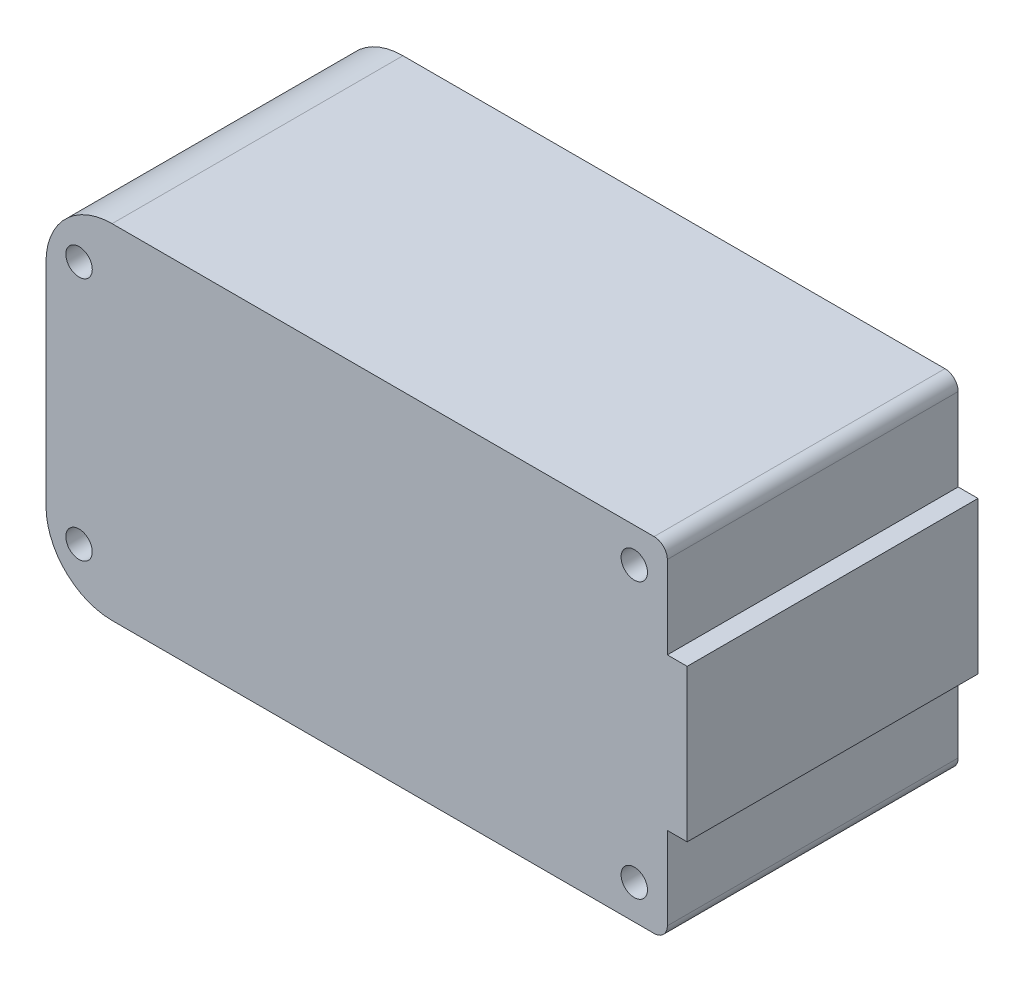
ISO-10303-21;
HEADER;
FILE_DESCRIPTION(('STEP AP214'),'2;1');
FILE_NAME('part.step','',(''),(''),'','','');
FILE_SCHEMA(('AUTOMOTIVE_DESIGN { 1 0 10303 214 1 1 1 1 }'));
ENDSEC;
DATA;
#1=APPLICATION_CONTEXT('core data for automotive mechanical design processes');
#2=APPLICATION_PROTOCOL_DEFINITION('international standard','automotive_design',2000,#1);
#3=PRODUCT_CONTEXT('',#1,'mechanical');
#4=PRODUCT('Part','Part','',(#3));
#5=PRODUCT_RELATED_PRODUCT_CATEGORY('part','',(#4));
#6=PRODUCT_DEFINITION_FORMATION('','',#4);
#7=PRODUCT_DEFINITION_CONTEXT('part definition',#1,'design');
#8=PRODUCT_DEFINITION('design','',#6,#7);
#9=PRODUCT_DEFINITION_SHAPE('','',#8);
#10=(LENGTH_UNIT() NAMED_UNIT(*) SI_UNIT(.MILLI.,.METRE.));
#11=(NAMED_UNIT(*) PLANE_ANGLE_UNIT() SI_UNIT($,.RADIAN.));
#12=(NAMED_UNIT(*) SI_UNIT($,.STERADIAN.) SOLID_ANGLE_UNIT());
#13=UNCERTAINTY_MEASURE_WITH_UNIT(LENGTH_MEASURE(1.E-05),#10,'distance_accuracy_value','');
#14=(GEOMETRIC_REPRESENTATION_CONTEXT(3) GLOBAL_UNCERTAINTY_ASSIGNED_CONTEXT((#13)) GLOBAL_UNIT_ASSIGNED_CONTEXT((#10,
#11,#12)) REPRESENTATION_CONTEXT('',''));
#15=CARTESIAN_POINT('',(0.,0.,0.));
#16=DIRECTION('',(0.,0.,1.));
#17=DIRECTION('',(1.,0.,0.));
#18=AXIS2_PLACEMENT_3D('',#15,#16,#17);
#19=CARTESIAN_POINT('',(0.,0.,11.));
#20=DIRECTION('',(0.,0.,1.));
#21=DIRECTION('',(1.,0.,0.));
#22=AXIS2_PLACEMENT_3D('',#19,#20,#21);
#23=PLANE('',#22);
#24=CARTESIAN_POINT('',(33.,-10.4,11.));
#25=DIRECTION('',(0.,0.,1.));
#26=DIRECTION('',(-1.,0.,0.));
#27=AXIS2_PLACEMENT_3D('',#24,#25,#26);
#28=CIRCLE('',#27,0.999999999999998);
#29=CARTESIAN_POINT('',(32.,-10.4,11.));
#30=VERTEX_POINT('',#29);
#31=EDGE_CURVE('E314',#30,#30,#28,.T.);
#32=ORIENTED_EDGE('',*,*,#31,.F.);
#33=EDGE_LOOP('',(#32));
#34=FACE_BOUND('',#33,.T.);
#35=CARTESIAN_POINT('',(-9.,9.25,11.));
#36=DIRECTION('',(0.,0.,1.));
#37=DIRECTION('',(1.,0.,0.));
#38=AXIS2_PLACEMENT_3D('',#35,#36,#37);
#39=CIRCLE('',#38,1.);
#40=CARTESIAN_POINT('',(-7.99999999999999,9.25,11.));
#41=VERTEX_POINT('',#40);
#42=EDGE_CURVE('E183',#41,#41,#39,.T.);
#43=ORIENTED_EDGE('',*,*,#42,.F.);
#44=EDGE_LOOP('',(#43));
#45=FACE_BOUND('',#44,.T.);
#46=DIRECTION('',(0.,1.,0.));
#47=VECTOR('',#46,1.);
#48=CARTESIAN_POINT('',(35.5,5.75,11.));
#49=LINE('',#48,#47);
#50=CARTESIAN_POINT('',(35.5,5.75,11.));
#51=VERTEX_POINT('',#50);
#52=CARTESIAN_POINT('',(35.5,12.,11.));
#53=VERTEX_POINT('',#52);
#54=EDGE_CURVE('E171',#51,#53,#49,.T.);
#55=ORIENTED_EDGE('',*,*,#54,.T.);
#56=CARTESIAN_POINT('',(34.5,12.,11.));
#57=DIRECTION('',(0.,0.,1.));
#58=DIRECTION('',(1.,0.,0.));
#59=AXIS2_PLACEMENT_3D('',#56,#57,#58);
#60=CIRCLE('',#59,1.);
#61=CARTESIAN_POINT('',(34.5,13.,11.));
#62=VERTEX_POINT('',#61);
#63=EDGE_CURVE('E256',#53,#62,#60,.T.);
#64=ORIENTED_EDGE('',*,*,#63,.T.);
#65=DIRECTION('',(-1.,0.,0.));
#66=VECTOR('',#65,1.);
#67=CARTESIAN_POINT('',(35.5,13.,11.));
#68=LINE('',#67,#66);
#69=CARTESIAN_POINT('',(-6.5,13.,11.));
#70=VERTEX_POINT('',#69);
#71=EDGE_CURVE('E174',#62,#70,#68,.T.);
#72=ORIENTED_EDGE('',*,*,#71,.T.);
#73=CARTESIAN_POINT('',(-6.5,7.99999999999999,11.));
#74=DIRECTION('',(0.,0.,1.));
#75=DIRECTION('',(1.,0.,0.));
#76=AXIS2_PLACEMENT_3D('',#73,#74,#75);
#77=CIRCLE('',#76,5.);
#78=CARTESIAN_POINT('',(-11.5,7.99999999999999,11.));
#79=VERTEX_POINT('',#78);
#80=EDGE_CURVE('E234',#70,#79,#77,.T.);
#81=ORIENTED_EDGE('',*,*,#80,.T.);
#82=DIRECTION('',(0.,-1.,0.));
#83=VECTOR('',#82,1.);
#84=CARTESIAN_POINT('',(-11.5,-13.,11.));
#85=LINE('',#84,#83);
#86=CARTESIAN_POINT('',(-11.5,-8.00000000000001,11.));
#87=VERTEX_POINT('',#86);
#88=EDGE_CURVE('E204',#79,#87,#85,.T.);
#89=ORIENTED_EDGE('',*,*,#88,.T.);
#90=CARTESIAN_POINT('',(-6.5,-8.,11.));
#91=DIRECTION('',(0.,0.,1.));
#92=DIRECTION('',(1.,0.,0.));
#93=AXIS2_PLACEMENT_3D('',#90,#91,#92);
#94=CIRCLE('',#93,5.);
#95=CARTESIAN_POINT('',(-6.5,-13.,11.));
#96=VERTEX_POINT('',#95);
#97=EDGE_CURVE('E231',#87,#96,#94,.T.);
#98=ORIENTED_EDGE('',*,*,#97,.T.);
#99=DIRECTION('',(1.,0.,0.));
#100=VECTOR('',#99,1.);
#101=CARTESIAN_POINT('',(35.5,-13.,11.));
#102=LINE('',#101,#100);
#103=CARTESIAN_POINT('',(34.5,-13.,11.));
#104=VERTEX_POINT('',#103);
#105=EDGE_CURVE('E145',#96,#104,#102,.T.);
#106=ORIENTED_EDGE('',*,*,#105,.T.);
#107=CARTESIAN_POINT('',(34.5,-12.,11.));
#108=DIRECTION('',(0.,0.,1.));
#109=DIRECTION('',(1.,0.,0.));
#110=AXIS2_PLACEMENT_3D('',#107,#108,#109);
#111=CIRCLE('',#110,1.);
#112=CARTESIAN_POINT('',(35.5,-12.,11.));
#113=VERTEX_POINT('',#112);
#114=EDGE_CURVE('E63',#104,#113,#111,.T.);
#115=ORIENTED_EDGE('',*,*,#114,.T.);
#116=DIRECTION('',(0.,1.,0.));
#117=VECTOR('',#116,1.);
#118=CARTESIAN_POINT('',(35.5,-13.,11.));
#119=LINE('',#118,#117);
#120=CARTESIAN_POINT('',(35.5,-5.75,11.));
#121=VERTEX_POINT('',#120);
#122=EDGE_CURVE('E134',#113,#121,#119,.T.);
#123=ORIENTED_EDGE('',*,*,#122,.T.);
#124=DIRECTION('',(1.,0.,0.));
#125=VECTOR('',#124,1.);
#126=CARTESIAN_POINT('',(35.5,-5.75,11.));
#127=LINE('',#126,#125);
#128=CARTESIAN_POINT('',(37.,-5.75,11.));
#129=VERTEX_POINT('',#128);
#130=EDGE_CURVE('E139',#121,#129,#127,.T.);
#131=ORIENTED_EDGE('',*,*,#130,.T.);
#132=DIRECTION('',(0.,1.,0.));
#133=VECTOR('',#132,1.);
#134=CARTESIAN_POINT('',(37.,5.75,11.));
#135=LINE('',#134,#133);
#136=CARTESIAN_POINT('',(37.,5.75,11.));
#137=VERTEX_POINT('',#136);
#138=EDGE_CURVE('E162',#129,#137,#135,.T.);
#139=ORIENTED_EDGE('',*,*,#138,.T.);
#140=DIRECTION('',(-1.,0.,0.));
#141=VECTOR('',#140,1.);
#142=CARTESIAN_POINT('',(35.5,5.75,11.));
#143=LINE('',#142,#141);
#144=EDGE_CURVE('E165',#137,#51,#143,.T.);
#145=ORIENTED_EDGE('',*,*,#144,.T.);
#146=EDGE_LOOP('',(#55,#64,#72,#81,#89,#98,#106,#115,#123,#131,#139,#145));
#147=FACE_BOUND('',#146,.T.);
#148=CARTESIAN_POINT('',(33.,10.4,11.));
#149=DIRECTION('',(0.,0.,1.));
#150=DIRECTION('',(1.,0.,0.));
#151=AXIS2_PLACEMENT_3D('',#148,#149,#150);
#152=CIRCLE('',#151,0.999999999999998);
#153=CARTESIAN_POINT('',(34.,10.4,11.));
#154=VERTEX_POINT('',#153);
#155=EDGE_CURVE('E306',#154,#154,#152,.T.);
#156=ORIENTED_EDGE('',*,*,#155,.F.);
#157=EDGE_LOOP('',(#156));
#158=FACE_BOUND('',#157,.T.);
#159=CARTESIAN_POINT('',(-9.,-9.25,11.));
#160=DIRECTION('',(0.,0.,1.));
#161=DIRECTION('',(-1.,0.,0.));
#162=AXIS2_PLACEMENT_3D('',#159,#160,#161);
#163=CIRCLE('',#162,1.);
#164=CARTESIAN_POINT('',(-10.,-9.25,11.));
#165=VERTEX_POINT('',#164);
#166=EDGE_CURVE('E322',#165,#165,#163,.T.);
#167=ORIENTED_EDGE('',*,*,#166,.F.);
#168=EDGE_LOOP('',(#167));
#169=FACE_BOUND('',#168,.T.);
#170=ADVANCED_FACE('F47',(#34,#45,#147,#158,#169),#23,.T.);
#171=CARTESIAN_POINT('',(0.,0.,-11.));
#172=DIRECTION('',(0.,0.,1.));
#173=DIRECTION('',(1.,0.,0.));
#174=AXIS2_PLACEMENT_3D('',#171,#172,#173);
#175=PLANE('',#174);
#176=CARTESIAN_POINT('',(33.,-10.4,-11.));
#177=DIRECTION('',(0.,0.,1.));
#178=DIRECTION('',(-1.,0.,0.));
#179=AXIS2_PLACEMENT_3D('',#176,#177,#178);
#180=CIRCLE('',#179,0.999999999999998);
#181=CARTESIAN_POINT('',(32.,-10.4,-11.));
#182=VERTEX_POINT('',#181);
#183=EDGE_CURVE('E318',#182,#182,#180,.T.);
#184=ORIENTED_EDGE('',*,*,#183,.T.);
#185=EDGE_LOOP('',(#184));
#186=FACE_BOUND('',#185,.T.);
#187=CARTESIAN_POINT('',(-9.,9.25,-11.));
#188=DIRECTION('',(0.,0.,1.));
#189=DIRECTION('',(1.,0.,0.));
#190=AXIS2_PLACEMENT_3D('',#187,#188,#189);
#191=CIRCLE('',#190,1.);
#192=CARTESIAN_POINT('',(-7.99999999999999,9.25,-11.));
#193=VERTEX_POINT('',#192);
#194=EDGE_CURVE('E302',#193,#193,#191,.T.);
#195=ORIENTED_EDGE('',*,*,#194,.T.);
#196=EDGE_LOOP('',(#195));
#197=FACE_BOUND('',#196,.T.);
#198=DIRECTION('',(-1.,0.,0.));
#199=VECTOR('',#198,1.);
#200=CARTESIAN_POINT('',(35.5,13.,-11.));
#201=LINE('',#200,#199);
#202=CARTESIAN_POINT('',(34.5,13.,-11.));
#203=VERTEX_POINT('',#202);
#204=CARTESIAN_POINT('',(-6.5,13.,-11.));
#205=VERTEX_POINT('',#204);
#206=EDGE_CURVE('E201',#203,#205,#201,.T.);
#207=ORIENTED_EDGE('',*,*,#206,.F.);
#208=CARTESIAN_POINT('',(34.5,12.,-11.));
#209=DIRECTION('',(0.,0.,1.));
#210=DIRECTION('',(1.,0.,0.));
#211=AXIS2_PLACEMENT_3D('',#208,#209,#210);
#212=CIRCLE('',#211,1.);
#213=CARTESIAN_POINT('',(35.5,12.,-11.));
#214=VERTEX_POINT('',#213);
#215=EDGE_CURVE('E248',#203,#214,#212,.F.);
#216=ORIENTED_EDGE('',*,*,#215,.T.);
#217=DIRECTION('',(0.,1.,0.));
#218=VECTOR('',#217,1.);
#219=CARTESIAN_POINT('',(35.5,5.75,-11.));
#220=LINE('',#219,#218);
#221=CARTESIAN_POINT('',(35.5,5.75,-11.));
#222=VERTEX_POINT('',#221);
#223=EDGE_CURVE('E197',#222,#214,#220,.T.);
#224=ORIENTED_EDGE('',*,*,#223,.F.);
#225=DIRECTION('',(-1.,0.,0.));
#226=VECTOR('',#225,1.);
#227=CARTESIAN_POINT('',(35.5,5.75,-11.));
#228=LINE('',#227,#226);
#229=CARTESIAN_POINT('',(37.,5.75,-11.));
#230=VERTEX_POINT('',#229);
#231=EDGE_CURVE('E194',#230,#222,#228,.T.);
#232=ORIENTED_EDGE('',*,*,#231,.F.);
#233=DIRECTION('',(0.,1.,0.));
#234=VECTOR('',#233,1.);
#235=CARTESIAN_POINT('',(37.,5.75,-11.));
#236=LINE('',#235,#234);
#237=CARTESIAN_POINT('',(37.,-5.75,-11.));
#238=VERTEX_POINT('',#237);
#239=EDGE_CURVE('E191',#238,#230,#236,.T.);
#240=ORIENTED_EDGE('',*,*,#239,.F.);
#241=DIRECTION('',(1.,0.,0.));
#242=VECTOR('',#241,1.);
#243=CARTESIAN_POINT('',(35.5,-5.75,-11.));
#244=LINE('',#243,#242);
#245=CARTESIAN_POINT('',(35.5,-5.75,-11.));
#246=VERTEX_POINT('',#245);
#247=EDGE_CURVE('E188',#246,#238,#244,.T.);
#248=ORIENTED_EDGE('',*,*,#247,.F.);
#249=DIRECTION('',(0.,1.,0.));
#250=VECTOR('',#249,1.);
#251=CARTESIAN_POINT('',(35.5,-13.,-11.));
#252=LINE('',#251,#250);
#253=CARTESIAN_POINT('',(35.5,-12.,-11.));
#254=VERTEX_POINT('',#253);
#255=EDGE_CURVE('E151',#254,#246,#252,.T.);
#256=ORIENTED_EDGE('',*,*,#255,.F.);
#257=CARTESIAN_POINT('',(34.5,-12.,-11.));
#258=DIRECTION('',(0.,0.,1.));
#259=DIRECTION('',(1.,0.,0.));
#260=AXIS2_PLACEMENT_3D('',#257,#258,#259);
#261=CIRCLE('',#260,1.);
#262=CARTESIAN_POINT('',(34.5,-13.,-11.));
#263=VERTEX_POINT('',#262);
#264=EDGE_CURVE('E245',#254,#263,#261,.F.);
#265=ORIENTED_EDGE('',*,*,#264,.T.);
#266=DIRECTION('',(1.,0.,0.));
#267=VECTOR('',#266,1.);
#268=CARTESIAN_POINT('',(35.5,-13.,-11.));
#269=LINE('',#268,#267);
#270=CARTESIAN_POINT('',(-6.5,-13.,-11.));
#271=VERTEX_POINT('',#270);
#272=EDGE_CURVE('E182',#271,#263,#269,.T.);
#273=ORIENTED_EDGE('',*,*,#272,.F.);
#274=CARTESIAN_POINT('',(-6.5,-8.,-11.));
#275=DIRECTION('',(0.,0.,1.));
#276=DIRECTION('',(1.,0.,0.));
#277=AXIS2_PLACEMENT_3D('',#274,#275,#276);
#278=CIRCLE('',#277,5.);
#279=CARTESIAN_POINT('',(-11.5,-8.00000000000001,-11.));
#280=VERTEX_POINT('',#279);
#281=EDGE_CURVE('E220',#271,#280,#278,.F.);
#282=ORIENTED_EDGE('',*,*,#281,.T.);
#283=DIRECTION('',(0.,-1.,0.));
#284=VECTOR('',#283,1.);
#285=CARTESIAN_POINT('',(-11.5,-13.,-11.));
#286=LINE('',#285,#284);
#287=CARTESIAN_POINT('',(-11.5,7.99999999999999,-11.));
#288=VERTEX_POINT('',#287);
#289=EDGE_CURVE('E178',#288,#280,#286,.T.);
#290=ORIENTED_EDGE('',*,*,#289,.F.);
#291=CARTESIAN_POINT('',(-6.5,7.99999999999999,-11.));
#292=DIRECTION('',(0.,0.,1.));
#293=DIRECTION('',(1.,0.,0.));
#294=AXIS2_PLACEMENT_3D('',#291,#292,#293);
#295=CIRCLE('',#294,5.);
#296=EDGE_CURVE('E223',#288,#205,#295,.F.);
#297=ORIENTED_EDGE('',*,*,#296,.T.);
#298=EDGE_LOOP('',(#207,#216,#224,#232,#240,#248,#256,#265,#273,#282,#290,#297));
#299=FACE_BOUND('',#298,.T.);
#300=CARTESIAN_POINT('',(33.,10.4,-11.));
#301=DIRECTION('',(0.,0.,1.));
#302=DIRECTION('',(1.,0.,0.));
#303=AXIS2_PLACEMENT_3D('',#300,#301,#302);
#304=CIRCLE('',#303,0.999999999999998);
#305=CARTESIAN_POINT('',(34.,10.4,-11.));
#306=VERTEX_POINT('',#305);
#307=EDGE_CURVE('E310',#306,#306,#304,.T.);
#308=ORIENTED_EDGE('',*,*,#307,.T.);
#309=EDGE_LOOP('',(#308));
#310=FACE_BOUND('',#309,.T.);
#311=CARTESIAN_POINT('',(-9.,-9.25,-11.));
#312=DIRECTION('',(0.,0.,1.));
#313=DIRECTION('',(-1.,0.,0.));
#314=AXIS2_PLACEMENT_3D('',#311,#312,#313);
#315=CIRCLE('',#314,1.);
#316=CARTESIAN_POINT('',(-10.,-9.25,-11.));
#317=VERTEX_POINT('',#316);
#318=EDGE_CURVE('E326',#317,#317,#315,.T.);
#319=ORIENTED_EDGE('',*,*,#318,.T.);
#320=EDGE_LOOP('',(#319));
#321=FACE_BOUND('',#320,.T.);
#322=ADVANCED_FACE('F262',(#186,#197,#299,#310,#321),#175,.F.);
#323=CARTESIAN_POINT('',(-11.5,-13.,11.));
#324=DIRECTION('',(1.,0.,0.));
#325=DIRECTION('',(0.,1.,0.));
#326=AXIS2_PLACEMENT_3D('',#323,#324,#325);
#327=PLANE('',#326);
#328=ORIENTED_EDGE('',*,*,#88,.F.);
#329=DIRECTION('',(0.,0.,-1.));
#330=VECTOR('',#329,1.);
#331=CARTESIAN_POINT('',(-11.5,7.99999999999999,11.));
#332=LINE('',#331,#330);
#333=EDGE_CURVE('E216',#79,#288,#332,.T.);
#334=ORIENTED_EDGE('',*,*,#333,.T.);
#335=ORIENTED_EDGE('',*,*,#289,.T.);
#336=DIRECTION('',(0.,0.,-1.));
#337=VECTOR('',#336,1.);
#338=CARTESIAN_POINT('',(-11.5,-8.,11.));
#339=LINE('',#338,#337);
#340=EDGE_CURVE('E155',#280,#87,#339,.F.);
#341=ORIENTED_EDGE('',*,*,#340,.T.);
#342=EDGE_LOOP('',(#328,#334,#335,#341));
#343=FACE_BOUND('',#342,.T.);
#344=ADVANCED_FACE('F295',(#343),#327,.F.);
#345=CARTESIAN_POINT('',(35.5,-13.,11.));
#346=DIRECTION('',(0.,1.,0.));
#347=DIRECTION('',(-1.,0.,0.));
#348=AXIS2_PLACEMENT_3D('',#345,#346,#347);
#349=PLANE('',#348);
#350=ORIENTED_EDGE('',*,*,#272,.T.);
#351=DIRECTION('',(0.,0.,-1.));
#352=VECTOR('',#351,1.);
#353=CARTESIAN_POINT('',(34.5,-13.,11.));
#354=LINE('',#353,#352);
#355=EDGE_CURVE('E11',#263,#104,#354,.F.);
#356=ORIENTED_EDGE('',*,*,#355,.T.);
#357=ORIENTED_EDGE('',*,*,#105,.F.);
#358=DIRECTION('',(0.,0.,-1.));
#359=VECTOR('',#358,1.);
#360=CARTESIAN_POINT('',(-6.5,-13.,11.));
#361=LINE('',#360,#359);
#362=EDGE_CURVE('E237',#96,#271,#361,.T.);
#363=ORIENTED_EDGE('',*,*,#362,.T.);
#364=EDGE_LOOP('',(#350,#356,#357,#363));
#365=FACE_BOUND('',#364,.T.);
#366=ADVANCED_FACE('F362',(#365),#349,.F.);
#367=CARTESIAN_POINT('',(35.5,-13.,11.));
#368=DIRECTION('',(-1.,0.,0.));
#369=DIRECTION('',(0.,0.,1.));
#370=AXIS2_PLACEMENT_3D('',#367,#368,#369);
#371=PLANE('',#370);
#372=ORIENTED_EDGE('',*,*,#122,.F.);
#373=DIRECTION('',(0.,0.,-1.));
#374=VECTOR('',#373,1.);
#375=CARTESIAN_POINT('',(35.5,-12.,11.));
#376=LINE('',#375,#374);
#377=EDGE_CURVE('E56',#113,#254,#376,.T.);
#378=ORIENTED_EDGE('',*,*,#377,.T.);
#379=ORIENTED_EDGE('',*,*,#255,.T.);
#380=DIRECTION('',(0.,0.,-1.));
#381=VECTOR('',#380,1.);
#382=CARTESIAN_POINT('',(35.5,-5.75,11.));
#383=LINE('',#382,#381);
#384=EDGE_CURVE('E148',#121,#246,#383,.T.);
#385=ORIENTED_EDGE('',*,*,#384,.F.);
#386=EDGE_LOOP('',(#372,#378,#379,#385));
#387=FACE_BOUND('',#386,.T.);
#388=ADVANCED_FACE('F149',(#387),#371,.F.);
#389=CARTESIAN_POINT('',(35.5,-5.75,11.));
#390=DIRECTION('',(0.,1.,0.));
#391=DIRECTION('',(0.,0.,1.));
#392=AXIS2_PLACEMENT_3D('',#389,#390,#391);
#393=PLANE('',#392);
#394=ORIENTED_EDGE('',*,*,#247,.T.);
#395=DIRECTION('',(0.,0.,-1.));
#396=VECTOR('',#395,1.);
#397=CARTESIAN_POINT('',(37.,-5.75,11.));
#398=LINE('',#397,#396);
#399=EDGE_CURVE('E156',#129,#238,#398,.T.);
#400=ORIENTED_EDGE('',*,*,#399,.F.);
#401=ORIENTED_EDGE('',*,*,#130,.F.);
#402=ORIENTED_EDGE('',*,*,#384,.T.);
#403=EDGE_LOOP('',(#394,#400,#401,#402));
#404=FACE_BOUND('',#403,.T.);
#405=ADVANCED_FACE('F158',(#404),#393,.F.);
#406=CARTESIAN_POINT('',(37.,5.75,11.));
#407=DIRECTION('',(-1.,0.,0.));
#408=DIRECTION('',(0.,0.,1.));
#409=AXIS2_PLACEMENT_3D('',#406,#407,#408);
#410=PLANE('',#409);
#411=ORIENTED_EDGE('',*,*,#239,.T.);
#412=DIRECTION('',(0.,0.,-1.));
#413=VECTOR('',#412,1.);
#414=CARTESIAN_POINT('',(37.,5.75,11.));
#415=LINE('',#414,#413);
#416=EDGE_CURVE('E208',#137,#230,#415,.T.);
#417=ORIENTED_EDGE('',*,*,#416,.F.);
#418=ORIENTED_EDGE('',*,*,#138,.F.);
#419=ORIENTED_EDGE('',*,*,#399,.T.);
#420=EDGE_LOOP('',(#411,#417,#418,#419));
#421=FACE_BOUND('',#420,.T.);
#422=ADVANCED_FACE('F268',(#421),#410,.F.);
#423=CARTESIAN_POINT('',(35.5,5.75,11.));
#424=DIRECTION('',(0.,-1.,0.));
#425=DIRECTION('',(0.,0.,-1.));
#426=AXIS2_PLACEMENT_3D('',#423,#424,#425);
#427=PLANE('',#426);
#428=ORIENTED_EDGE('',*,*,#231,.T.);
#429=DIRECTION('',(0.,0.,-1.));
#430=VECTOR('',#429,1.);
#431=CARTESIAN_POINT('',(35.5,5.75,11.));
#432=LINE('',#431,#430);
#433=EDGE_CURVE('E177',#51,#222,#432,.T.);
#434=ORIENTED_EDGE('',*,*,#433,.F.);
#435=ORIENTED_EDGE('',*,*,#144,.F.);
#436=ORIENTED_EDGE('',*,*,#416,.T.);
#437=EDGE_LOOP('',(#428,#434,#435,#436));
#438=FACE_BOUND('',#437,.T.);
#439=ADVANCED_FACE('F275',(#438),#427,.F.);
#440=CARTESIAN_POINT('',(35.5,5.75,11.));
#441=DIRECTION('',(-1.,0.,0.));
#442=DIRECTION('',(0.,0.,1.));
#443=AXIS2_PLACEMENT_3D('',#440,#441,#442);
#444=PLANE('',#443);
#445=ORIENTED_EDGE('',*,*,#223,.T.);
#446=DIRECTION('',(0.,0.,-1.));
#447=VECTOR('',#446,1.);
#448=CARTESIAN_POINT('',(35.5,12.,11.));
#449=LINE('',#448,#447);
#450=EDGE_CURVE('E251',#214,#53,#449,.F.);
#451=ORIENTED_EDGE('',*,*,#450,.T.);
#452=ORIENTED_EDGE('',*,*,#54,.F.);
#453=ORIENTED_EDGE('',*,*,#433,.T.);
#454=EDGE_LOOP('',(#445,#451,#452,#453));
#455=FACE_BOUND('',#454,.T.);
#456=ADVANCED_FACE('F278',(#455),#444,.F.);
#457=CARTESIAN_POINT('',(35.5,13.,11.));
#458=DIRECTION('',(0.,-1.,0.));
#459=DIRECTION('',(1.,0.,0.));
#460=AXIS2_PLACEMENT_3D('',#457,#458,#459);
#461=PLANE('',#460);
#462=ORIENTED_EDGE('',*,*,#71,.F.);
#463=DIRECTION('',(0.,0.,-1.));
#464=VECTOR('',#463,1.);
#465=CARTESIAN_POINT('',(34.5,13.,11.));
#466=LINE('',#465,#464);
#467=EDGE_CURVE('E241',#62,#203,#466,.T.);
#468=ORIENTED_EDGE('',*,*,#467,.T.);
#469=ORIENTED_EDGE('',*,*,#206,.T.);
#470=DIRECTION('',(0.,0.,-1.));
#471=VECTOR('',#470,1.);
#472=CARTESIAN_POINT('',(-6.5,13.,11.));
#473=LINE('',#472,#471);
#474=EDGE_CURVE('E227',#205,#70,#473,.F.);
#475=ORIENTED_EDGE('',*,*,#474,.T.);
#476=EDGE_LOOP('',(#462,#468,#469,#475));
#477=FACE_BOUND('',#476,.T.);
#478=ADVANCED_FACE('F285',(#477),#461,.F.);
#479=CARTESIAN_POINT('',(-9.,9.25,11.));
#480=DIRECTION('',(0.,0.,-1.));
#481=DIRECTION('',(-1.,0.,0.));
#482=AXIS2_PLACEMENT_3D('',#479,#480,#481);
#483=CYLINDRICAL_SURFACE('',#482,1.);
#484=ORIENTED_EDGE('',*,*,#42,.T.);
#485=EDGE_LOOP('',(#484));
#486=FACE_BOUND('',#485,.T.);
#487=ORIENTED_EDGE('',*,*,#194,.F.);
#488=EDGE_LOOP('',(#487));
#489=FACE_BOUND('',#488,.T.);
#490=ADVANCED_FACE('F347',(#486,#489),#483,.F.);
#491=CARTESIAN_POINT('',(33.,10.4,11.));
#492=DIRECTION('',(0.,0.,-1.));
#493=DIRECTION('',(-1.,0.,0.));
#494=AXIS2_PLACEMENT_3D('',#491,#492,#493);
#495=CYLINDRICAL_SURFACE('',#494,0.999999999999998);
#496=ORIENTED_EDGE('',*,*,#155,.T.);
#497=EDGE_LOOP('',(#496));
#498=FACE_BOUND('',#497,.T.);
#499=ORIENTED_EDGE('',*,*,#307,.F.);
#500=EDGE_LOOP('',(#499));
#501=FACE_BOUND('',#500,.T.);
#502=ADVANCED_FACE('F402',(#498,#501),#495,.F.);
#503=CARTESIAN_POINT('',(33.,-10.4,11.));
#504=DIRECTION('',(0.,0.,-1.));
#505=DIRECTION('',(-1.,0.,0.));
#506=AXIS2_PLACEMENT_3D('',#503,#504,#505);
#507=CYLINDRICAL_SURFACE('',#506,0.999999999999998);
#508=ORIENTED_EDGE('',*,*,#31,.T.);
#509=EDGE_LOOP('',(#508));
#510=FACE_BOUND('',#509,.T.);
#511=ORIENTED_EDGE('',*,*,#183,.F.);
#512=EDGE_LOOP('',(#511));
#513=FACE_BOUND('',#512,.T.);
#514=ADVANCED_FACE('F395',(#510,#513),#507,.F.);
#515=CARTESIAN_POINT('',(-9.,-9.25,11.));
#516=DIRECTION('',(0.,0.,-1.));
#517=DIRECTION('',(-1.,0.,0.));
#518=AXIS2_PLACEMENT_3D('',#515,#516,#517);
#519=CYLINDRICAL_SURFACE('',#518,1.);
#520=ORIENTED_EDGE('',*,*,#166,.T.);
#521=EDGE_LOOP('',(#520));
#522=FACE_BOUND('',#521,.T.);
#523=ORIENTED_EDGE('',*,*,#318,.F.);
#524=EDGE_LOOP('',(#523));
#525=FACE_BOUND('',#524,.T.);
#526=ADVANCED_FACE('F334',(#522,#525),#519,.F.);
#527=CARTESIAN_POINT('',(-6.5,7.99999999999999,11.));
#528=DIRECTION('',(0.,0.,-1.));
#529=DIRECTION('',(-1.,0.,0.));
#530=AXIS2_PLACEMENT_3D('',#527,#528,#529);
#531=CYLINDRICAL_SURFACE('',#530,5.);
#532=ORIENTED_EDGE('',*,*,#80,.F.);
#533=ORIENTED_EDGE('',*,*,#474,.F.);
#534=ORIENTED_EDGE('',*,*,#296,.F.);
#535=ORIENTED_EDGE('',*,*,#333,.F.);
#536=EDGE_LOOP('',(#532,#533,#534,#535));
#537=FACE_BOUND('',#536,.T.);
#538=ADVANCED_FACE('F290',(#537),#531,.T.);
#539=CARTESIAN_POINT('',(-6.5,-8.,11.));
#540=DIRECTION('',(0.,0.,-1.));
#541=DIRECTION('',(-1.,0.,0.));
#542=AXIS2_PLACEMENT_3D('',#539,#540,#541);
#543=CYLINDRICAL_SURFACE('',#542,5.);
#544=ORIENTED_EDGE('',*,*,#97,.F.);
#545=ORIENTED_EDGE('',*,*,#340,.F.);
#546=ORIENTED_EDGE('',*,*,#281,.F.);
#547=ORIENTED_EDGE('',*,*,#362,.F.);
#548=EDGE_LOOP('',(#544,#545,#546,#547));
#549=FACE_BOUND('',#548,.T.);
#550=ADVANCED_FACE('F369',(#549),#543,.T.);
#551=CARTESIAN_POINT('',(34.5,12.,11.));
#552=DIRECTION('',(0.,0.,-1.));
#553=DIRECTION('',(-1.,0.,0.));
#554=AXIS2_PLACEMENT_3D('',#551,#552,#553);
#555=CYLINDRICAL_SURFACE('',#554,1.);
#556=ORIENTED_EDGE('',*,*,#63,.F.);
#557=ORIENTED_EDGE('',*,*,#450,.F.);
#558=ORIENTED_EDGE('',*,*,#215,.F.);
#559=ORIENTED_EDGE('',*,*,#467,.F.);
#560=EDGE_LOOP('',(#556,#557,#558,#559));
#561=FACE_BOUND('',#560,.T.);
#562=ADVANCED_FACE('F281',(#561),#555,.T.);
#563=CARTESIAN_POINT('',(34.5,-12.,11.));
#564=DIRECTION('',(0.,0.,-1.));
#565=DIRECTION('',(-1.,0.,0.));
#566=AXIS2_PLACEMENT_3D('',#563,#564,#565);
#567=CYLINDRICAL_SURFACE('',#566,1.);
#568=ORIENTED_EDGE('',*,*,#114,.F.);
#569=ORIENTED_EDGE('',*,*,#355,.F.);
#570=ORIENTED_EDGE('',*,*,#264,.F.);
#571=ORIENTED_EDGE('',*,*,#377,.F.);
#572=EDGE_LOOP('',(#568,#569,#570,#571));
#573=FACE_BOUND('',#572,.T.);
#574=ADVANCED_FACE('F49',(#573),#567,.T.);
#575=CLOSED_SHELL('',(#170,#322,#344,#366,#388,#405,#422,#439,#456,#478,#490,#502,#514,#526,
#538,#550,#562,#574));
#576=MANIFOLD_SOLID_BREP('B2',#575);
#577=ADVANCED_BREP_SHAPE_REPRESENTATION('',(#18,#576),#14);
#578=SHAPE_DEFINITION_REPRESENTATION(#9,#577);
ENDSEC;
END-ISO-10303-21;
